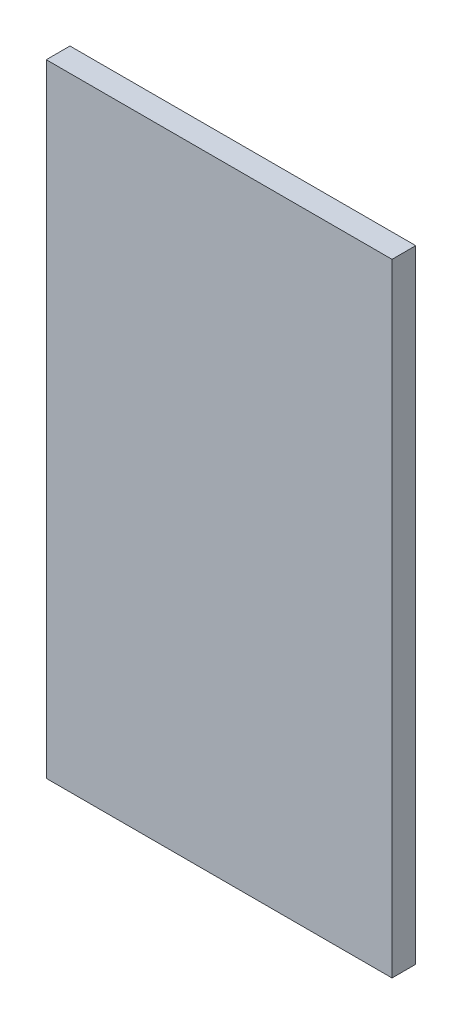
ISO-10303-21;
HEADER;
FILE_DESCRIPTION(('STEP AP214'),'2;1');
FILE_NAME('part.step','',(''),(''),'','','');
FILE_SCHEMA(('AUTOMOTIVE_DESIGN { 1 0 10303 214 1 1 1 1 }'));
ENDSEC;
DATA;
#1=APPLICATION_CONTEXT('core data for automotive mechanical design processes');
#2=APPLICATION_PROTOCOL_DEFINITION('international standard','automotive_design',2000,#1);
#3=PRODUCT_CONTEXT('',#1,'mechanical');
#4=PRODUCT('Part','Part','',(#3));
#5=PRODUCT_RELATED_PRODUCT_CATEGORY('part','',(#4));
#6=PRODUCT_DEFINITION_FORMATION('','',#4);
#7=PRODUCT_DEFINITION_CONTEXT('part definition',#1,'design');
#8=PRODUCT_DEFINITION('design','',#6,#7);
#9=PRODUCT_DEFINITION_SHAPE('','',#8);
#10=(LENGTH_UNIT() NAMED_UNIT(*) SI_UNIT(.MILLI.,.METRE.));
#11=(NAMED_UNIT(*) PLANE_ANGLE_UNIT() SI_UNIT($,.RADIAN.));
#12=(NAMED_UNIT(*) SI_UNIT($,.STERADIAN.) SOLID_ANGLE_UNIT());
#13=UNCERTAINTY_MEASURE_WITH_UNIT(LENGTH_MEASURE(1.E-05),#10,'distance_accuracy_value','');
#14=(GEOMETRIC_REPRESENTATION_CONTEXT(3) GLOBAL_UNCERTAINTY_ASSIGNED_CONTEXT((#13)) GLOBAL_UNIT_ASSIGNED_CONTEXT((#10,
#11,#12)) REPRESENTATION_CONTEXT('',''));
#15=CARTESIAN_POINT('',(0.,0.,0.));
#16=DIRECTION('',(0.,0.,1.));
#17=DIRECTION('',(1.,0.,0.));
#18=AXIS2_PLACEMENT_3D('',#15,#16,#17);
#19=CARTESIAN_POINT('',(1.80008,0.7,0.));
#20=DIRECTION('',(0.,0.,-1.));
#21=DIRECTION('',(-1.,0.,0.));
#22=AXIS2_PLACEMENT_3D('',#19,#20,#21);
#23=PLANE('',#22);
#24=DIRECTION('',(1.,0.,0.));
#25=VECTOR('',#24,1.);
#26=CARTESIAN_POINT('',(1.55008,1.15,0.));
#27=LINE('',#26,#25);
#28=CARTESIAN_POINT('',(1.55008,1.15,0.));
#29=VERTEX_POINT('',#28);
#30=CARTESIAN_POINT('',(2.05008,1.15,0.));
#31=VERTEX_POINT('',#30);
#32=EDGE_CURVE('E55',#29,#31,#27,.T.);
#33=ORIENTED_EDGE('',*,*,#32,.T.);
#34=DIRECTION('',(0.,1.,0.));
#35=VECTOR('',#34,1.);
#36=CARTESIAN_POINT('',(2.05008,1.15,0.));
#37=LINE('',#36,#35);
#38=CARTESIAN_POINT('',(2.05008,0.25,0.));
#39=VERTEX_POINT('',#38);
#40=EDGE_CURVE('E57',#31,#39,#37,.F.);
#41=ORIENTED_EDGE('',*,*,#40,.T.);
#42=DIRECTION('',(1.,0.,0.));
#43=VECTOR('',#42,1.);
#44=CARTESIAN_POINT('',(2.05008,0.25,0.));
#45=LINE('',#44,#43);
#46=CARTESIAN_POINT('',(1.55008,0.25,0.));
#47=VERTEX_POINT('',#46);
#48=EDGE_CURVE('E20',#39,#47,#45,.F.);
#49=ORIENTED_EDGE('',*,*,#48,.T.);
#50=DIRECTION('',(0.,1.,0.));
#51=VECTOR('',#50,1.);
#52=CARTESIAN_POINT('',(1.55008,0.25,0.));
#53=LINE('',#52,#51);
#54=EDGE_CURVE('E80',#47,#29,#53,.T.);
#55=ORIENTED_EDGE('',*,*,#54,.T.);
#56=EDGE_LOOP('',(#33,#41,#49,#55));
#57=FACE_BOUND('',#56,.T.);
#58=ADVANCED_FACE('F17',(#57),#23,.T.);
#59=CARTESIAN_POINT('',(2.05008,0.25,0.));
#60=DIRECTION('',(0.,1.,0.));
#61=DIRECTION('',(0.,0.,1.));
#62=AXIS2_PLACEMENT_3D('',#59,#60,#61);
#63=PLANE('',#62);
#64=DIRECTION('',(0.,0.,-1.));
#65=VECTOR('',#64,1.);
#66=CARTESIAN_POINT('',(1.55008,0.25,0.));
#67=LINE('',#66,#65);
#68=CARTESIAN_POINT('',(1.55008,0.25,0.03429));
#69=VERTEX_POINT('',#68);
#70=EDGE_CURVE('E68',#69,#47,#67,.T.);
#71=ORIENTED_EDGE('',*,*,#70,.T.);
#72=ORIENTED_EDGE('',*,*,#48,.F.);
#73=DIRECTION('',(0.,0.,1.));
#74=VECTOR('',#73,1.);
#75=CARTESIAN_POINT('',(2.05008,0.25,0.));
#76=LINE('',#75,#74);
#77=CARTESIAN_POINT('',(2.05008,0.25,0.03429));
#78=VERTEX_POINT('',#77);
#79=EDGE_CURVE('E63',#39,#78,#76,.T.);
#80=ORIENTED_EDGE('',*,*,#79,.T.);
#81=DIRECTION('',(1.,0.,0.));
#82=VECTOR('',#81,1.);
#83=CARTESIAN_POINT('',(1.80008,0.25,0.03429));
#84=LINE('',#83,#82);
#85=EDGE_CURVE('E83',#69,#78,#84,.T.);
#86=ORIENTED_EDGE('',*,*,#85,.F.);
#87=EDGE_LOOP('',(#71,#72,#80,#86));
#88=FACE_BOUND('',#87,.T.);
#89=ADVANCED_FACE('F65',(#88),#63,.F.);
#90=CARTESIAN_POINT('',(2.05008,1.15,0.));
#91=DIRECTION('',(-1.,0.,0.));
#92=DIRECTION('',(0.,0.,1.));
#93=AXIS2_PLACEMENT_3D('',#90,#91,#92);
#94=PLANE('',#93);
#95=ORIENTED_EDGE('',*,*,#79,.F.);
#96=ORIENTED_EDGE('',*,*,#40,.F.);
#97=DIRECTION('',(0.,0.,-1.));
#98=VECTOR('',#97,1.);
#99=CARTESIAN_POINT('',(2.05008,1.15,0.));
#100=LINE('',#99,#98);
#101=CARTESIAN_POINT('',(2.05008,1.15,0.03429));
#102=VERTEX_POINT('',#101);
#103=EDGE_CURVE('E75',#31,#102,#100,.F.);
#104=ORIENTED_EDGE('',*,*,#103,.T.);
#105=DIRECTION('',(0.,1.,0.));
#106=VECTOR('',#105,1.);
#107=CARTESIAN_POINT('',(2.05008,0.7,0.03429));
#108=LINE('',#107,#106);
#109=EDGE_CURVE('E72',#78,#102,#108,.T.);
#110=ORIENTED_EDGE('',*,*,#109,.F.);
#111=EDGE_LOOP('',(#95,#96,#104,#110));
#112=FACE_BOUND('',#111,.T.);
#113=ADVANCED_FACE('F70',(#112),#94,.F.);
#114=CARTESIAN_POINT('',(1.55008,1.15,0.));
#115=DIRECTION('',(0.,-1.,0.));
#116=DIRECTION('',(0.,0.,-1.));
#117=AXIS2_PLACEMENT_3D('',#114,#115,#116);
#118=PLANE('',#117);
#119=ORIENTED_EDGE('',*,*,#103,.F.);
#120=ORIENTED_EDGE('',*,*,#32,.F.);
#121=DIRECTION('',(0.,0.,-1.));
#122=VECTOR('',#121,1.);
#123=CARTESIAN_POINT('',(1.55008,1.15,0.));
#124=LINE('',#123,#122);
#125=CARTESIAN_POINT('',(1.55008,1.15,0.03429));
#126=VERTEX_POINT('',#125);
#127=EDGE_CURVE('E35',#29,#126,#124,.F.);
#128=ORIENTED_EDGE('',*,*,#127,.T.);
#129=DIRECTION('',(1.,0.,0.));
#130=VECTOR('',#129,1.);
#131=CARTESIAN_POINT('',(1.80008,1.15,0.03429));
#132=LINE('',#131,#130);
#133=EDGE_CURVE('E26',#102,#126,#132,.F.);
#134=ORIENTED_EDGE('',*,*,#133,.F.);
#135=EDGE_LOOP('',(#119,#120,#128,#134));
#136=FACE_BOUND('',#135,.T.);
#137=ADVANCED_FACE('F89',(#136),#118,.F.);
#138=CARTESIAN_POINT('',(1.55008,0.25,0.));
#139=DIRECTION('',(1.,0.,0.));
#140=DIRECTION('',(0.,0.,-1.));
#141=AXIS2_PLACEMENT_3D('',#138,#139,#140);
#142=PLANE('',#141);
#143=ORIENTED_EDGE('',*,*,#127,.F.);
#144=ORIENTED_EDGE('',*,*,#54,.F.);
#145=ORIENTED_EDGE('',*,*,#70,.F.);
#146=DIRECTION('',(0.,1.,0.));
#147=VECTOR('',#146,1.);
#148=CARTESIAN_POINT('',(1.55008,0.7,0.03429));
#149=LINE('',#148,#147);
#150=EDGE_CURVE('E11',#126,#69,#149,.F.);
#151=ORIENTED_EDGE('',*,*,#150,.F.);
#152=EDGE_LOOP('',(#143,#144,#145,#151));
#153=FACE_BOUND('',#152,.T.);
#154=ADVANCED_FACE('F91',(#153),#142,.F.);
#155=CARTESIAN_POINT('',(1.80008,0.7,0.03429));
#156=DIRECTION('',(0.,0.,1.));
#157=DIRECTION('',(1.,0.,0.));
#158=AXIS2_PLACEMENT_3D('',#155,#156,#157);
#159=PLANE('',#158);
#160=ORIENTED_EDGE('',*,*,#133,.T.);
#161=ORIENTED_EDGE('',*,*,#150,.T.);
#162=ORIENTED_EDGE('',*,*,#85,.T.);
#163=ORIENTED_EDGE('',*,*,#109,.T.);
#164=EDGE_LOOP('',(#160,#161,#162,#163));
#165=FACE_BOUND('',#164,.T.);
#166=ADVANCED_FACE('F88',(#165),#159,.T.);
#167=CLOSED_SHELL('',(#58,#89,#113,#137,#154,#166));
#168=MANIFOLD_SOLID_BREP('B1',#167);
#169=ADVANCED_BREP_SHAPE_REPRESENTATION('',(#18,#168),#14);
#170=SHAPE_DEFINITION_REPRESENTATION(#9,#169);
ENDSEC;
END-ISO-10303-21;
